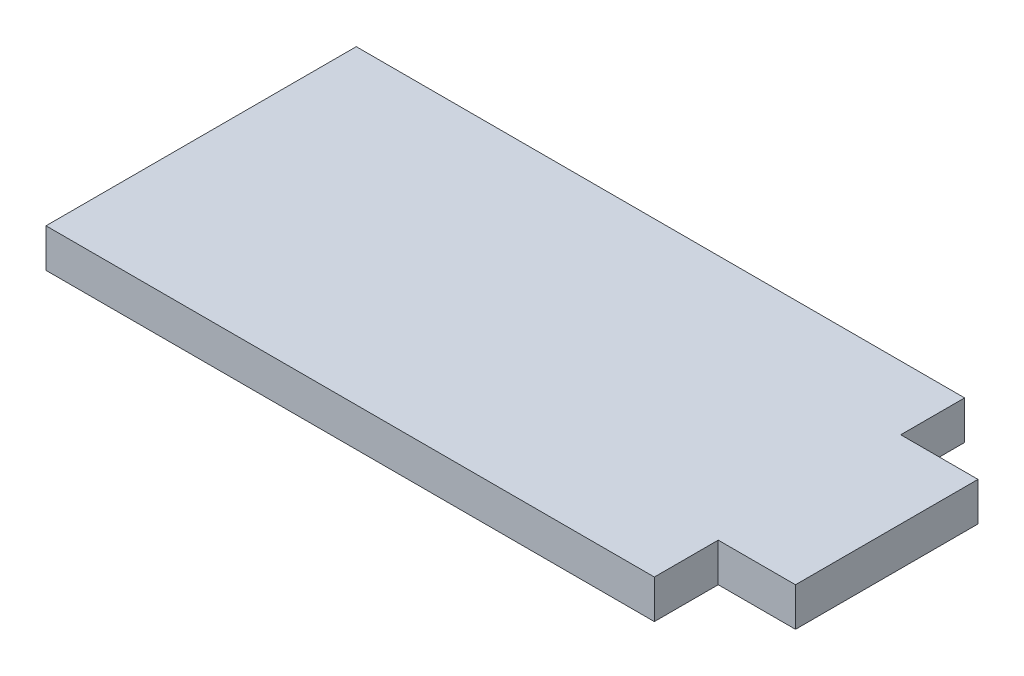
ISO-10303-21;
HEADER;
FILE_DESCRIPTION(('STEP AP214'),'2;1');
FILE_NAME('part.step','',(''),(''),'','','');
FILE_SCHEMA(('AUTOMOTIVE_DESIGN { 1 0 10303 214 1 1 1 1 }'));
ENDSEC;
DATA;
#1=APPLICATION_CONTEXT('core data for automotive mechanical design processes');
#2=APPLICATION_PROTOCOL_DEFINITION('international standard','automotive_design',2000,#1);
#3=PRODUCT_CONTEXT('',#1,'mechanical');
#4=PRODUCT('Part','Part','',(#3));
#5=PRODUCT_RELATED_PRODUCT_CATEGORY('part','',(#4));
#6=PRODUCT_DEFINITION_FORMATION('','',#4);
#7=PRODUCT_DEFINITION_CONTEXT('part definition',#1,'design');
#8=PRODUCT_DEFINITION('design','',#6,#7);
#9=PRODUCT_DEFINITION_SHAPE('','',#8);
#10=(LENGTH_UNIT() NAMED_UNIT(*) SI_UNIT(.MILLI.,.METRE.));
#11=(NAMED_UNIT(*) PLANE_ANGLE_UNIT() SI_UNIT($,.RADIAN.));
#12=(NAMED_UNIT(*) SI_UNIT($,.STERADIAN.) SOLID_ANGLE_UNIT());
#13=UNCERTAINTY_MEASURE_WITH_UNIT(LENGTH_MEASURE(1.E-05),#10,'distance_accuracy_value','');
#14=(GEOMETRIC_REPRESENTATION_CONTEXT(3) GLOBAL_UNCERTAINTY_ASSIGNED_CONTEXT((#13)) GLOBAL_UNIT_ASSIGNED_CONTEXT((#10,
#11,#12)) REPRESENTATION_CONTEXT('',''));
#15=CARTESIAN_POINT('',(0.,0.,0.));
#16=DIRECTION('',(0.,0.,1.));
#17=DIRECTION('',(1.,0.,0.));
#18=AXIS2_PLACEMENT_3D('',#15,#16,#17);
#19=CARTESIAN_POINT('',(-25.,3.175,0.));
#20=DIRECTION('',(-1.,0.,0.));
#21=DIRECTION('',(0.,0.,1.));
#22=AXIS2_PLACEMENT_3D('',#19,#20,#21);
#23=PLANE('',#22);
#24=DIRECTION('',(0.,0.,-1.));
#25=VECTOR('',#24,1.);
#26=CARTESIAN_POINT('',(-25.,0.,0.));
#27=LINE('',#26,#25);
#28=CARTESIAN_POINT('',(-25.,0.,20.25));
#29=VERTEX_POINT('',#28);
#30=CARTESIAN_POINT('',(-25.,0.,-5.25));
#31=VERTEX_POINT('',#30);
#32=EDGE_CURVE('E127',#29,#31,#27,.T.);
#33=ORIENTED_EDGE('',*,*,#32,.F.);
#34=DIRECTION('',(0.,-1.,0.));
#35=VECTOR('',#34,1.);
#36=CARTESIAN_POINT('',(-25.,3.175,20.25));
#37=LINE('',#36,#35);
#38=CARTESIAN_POINT('',(-25.,3.175,20.25));
#39=VERTEX_POINT('',#38);
#40=EDGE_CURVE('E11',#39,#29,#37,.T.);
#41=ORIENTED_EDGE('',*,*,#40,.F.);
#42=DIRECTION('',(0.,0.,-1.));
#43=VECTOR('',#42,1.);
#44=CARTESIAN_POINT('',(-25.,3.175,0.));
#45=LINE('',#44,#43);
#46=CARTESIAN_POINT('',(-25.,3.175,-5.25));
#47=VERTEX_POINT('',#46);
#48=EDGE_CURVE('E147',#39,#47,#45,.T.);
#49=ORIENTED_EDGE('',*,*,#48,.T.);
#50=DIRECTION('',(0.,-1.,0.));
#51=VECTOR('',#50,1.);
#52=CARTESIAN_POINT('',(-25.,3.175,-5.25));
#53=LINE('',#52,#51);
#54=EDGE_CURVE('E50',#47,#31,#53,.T.);
#55=ORIENTED_EDGE('',*,*,#54,.T.);
#56=EDGE_LOOP('',(#33,#41,#49,#55));
#57=FACE_BOUND('',#56,.T.);
#58=ADVANCED_FACE('F34',(#57),#23,.T.);
#59=CARTESIAN_POINT('',(0.,3.175,20.25));
#60=DIRECTION('',(0.,0.,1.));
#61=DIRECTION('',(1.,0.,0.));
#62=AXIS2_PLACEMENT_3D('',#59,#60,#61);
#63=PLANE('',#62);
#64=DIRECTION('',(-1.,0.,0.));
#65=VECTOR('',#64,1.);
#66=CARTESIAN_POINT('',(0.,0.,20.25));
#67=LINE('',#66,#65);
#68=CARTESIAN_POINT('',(25.,0.,20.25));
#69=VERTEX_POINT('',#68);
#70=EDGE_CURVE('E129',#69,#29,#67,.T.);
#71=ORIENTED_EDGE('',*,*,#70,.F.);
#72=DIRECTION('',(0.,-1.,0.));
#73=VECTOR('',#72,1.);
#74=CARTESIAN_POINT('',(25.,3.175,20.25));
#75=LINE('',#74,#73);
#76=CARTESIAN_POINT('',(25.,3.175,20.25));
#77=VERTEX_POINT('',#76);
#78=EDGE_CURVE('E42',#77,#69,#75,.T.);
#79=ORIENTED_EDGE('',*,*,#78,.F.);
#80=DIRECTION('',(-1.,0.,0.));
#81=VECTOR('',#80,1.);
#82=CARTESIAN_POINT('',(0.,3.175,20.25));
#83=LINE('',#82,#81);
#84=EDGE_CURVE('E173',#77,#39,#83,.T.);
#85=ORIENTED_EDGE('',*,*,#84,.T.);
#86=ORIENTED_EDGE('',*,*,#40,.T.);
#87=EDGE_LOOP('',(#71,#79,#85,#86));
#88=FACE_BOUND('',#87,.T.);
#89=ADVANCED_FACE('F164',(#88),#63,.T.);
#90=CARTESIAN_POINT('',(25.,3.175,0.));
#91=DIRECTION('',(1.,0.,0.));
#92=DIRECTION('',(0.,0.,-1.));
#93=AXIS2_PLACEMENT_3D('',#90,#91,#92);
#94=PLANE('',#93);
#95=DIRECTION('',(0.,0.,1.));
#96=VECTOR('',#95,1.);
#97=CARTESIAN_POINT('',(25.,0.,0.));
#98=LINE('',#97,#96);
#99=CARTESIAN_POINT('',(25.,0.,15.));
#100=VERTEX_POINT('',#99);
#101=EDGE_CURVE('E132',#100,#69,#98,.T.);
#102=ORIENTED_EDGE('',*,*,#101,.F.);
#103=DIRECTION('',(0.,-1.,0.));
#104=VECTOR('',#103,1.);
#105=CARTESIAN_POINT('',(25.,3.175,15.));
#106=LINE('',#105,#104);
#107=CARTESIAN_POINT('',(25.,3.175,15.));
#108=VERTEX_POINT('',#107);
#109=EDGE_CURVE('E153',#108,#100,#106,.T.);
#110=ORIENTED_EDGE('',*,*,#109,.F.);
#111=DIRECTION('',(0.,0.,1.));
#112=VECTOR('',#111,1.);
#113=CARTESIAN_POINT('',(25.,3.175,0.));
#114=LINE('',#113,#112);
#115=EDGE_CURVE('E160',#108,#77,#114,.T.);
#116=ORIENTED_EDGE('',*,*,#115,.T.);
#117=ORIENTED_EDGE('',*,*,#78,.T.);
#118=EDGE_LOOP('',(#102,#110,#116,#117));
#119=FACE_BOUND('',#118,.T.);
#120=ADVANCED_FACE('F158',(#119),#94,.T.);
#121=CARTESIAN_POINT('',(0.,3.175,15.));
#122=DIRECTION('',(0.,0.,1.));
#123=DIRECTION('',(1.,0.,0.));
#124=AXIS2_PLACEMENT_3D('',#121,#122,#123);
#125=PLANE('',#124);
#126=DIRECTION('',(-1.,0.,0.));
#127=VECTOR('',#126,1.);
#128=CARTESIAN_POINT('',(0.,0.,15.));
#129=LINE('',#128,#127);
#130=CARTESIAN_POINT('',(31.35,0.,15.));
#131=VERTEX_POINT('',#130);
#132=EDGE_CURVE('E135',#131,#100,#129,.T.);
#133=ORIENTED_EDGE('',*,*,#132,.F.);
#134=DIRECTION('',(0.,-1.,0.));
#135=VECTOR('',#134,1.);
#136=CARTESIAN_POINT('',(31.35,3.175,15.));
#137=LINE('',#136,#135);
#138=CARTESIAN_POINT('',(31.35,3.175,15.));
#139=VERTEX_POINT('',#138);
#140=EDGE_CURVE('E151',#139,#131,#137,.T.);
#141=ORIENTED_EDGE('',*,*,#140,.F.);
#142=DIRECTION('',(-1.,0.,0.));
#143=VECTOR('',#142,1.);
#144=CARTESIAN_POINT('',(0.,3.175,15.));
#145=LINE('',#144,#143);
#146=EDGE_CURVE('E172',#139,#108,#145,.T.);
#147=ORIENTED_EDGE('',*,*,#146,.T.);
#148=ORIENTED_EDGE('',*,*,#109,.T.);
#149=EDGE_LOOP('',(#133,#141,#147,#148));
#150=FACE_BOUND('',#149,.T.);
#151=ADVANCED_FACE('F170',(#150),#125,.T.);
#152=CARTESIAN_POINT('',(31.35,3.175,0.));
#153=DIRECTION('',(1.,0.,0.));
#154=DIRECTION('',(0.,0.,-1.));
#155=AXIS2_PLACEMENT_3D('',#152,#153,#154);
#156=PLANE('',#155);
#157=DIRECTION('',(0.,0.,1.));
#158=VECTOR('',#157,1.);
#159=CARTESIAN_POINT('',(31.35,0.,0.));
#160=LINE('',#159,#158);
#161=CARTESIAN_POINT('',(31.35,0.,0.));
#162=VERTEX_POINT('',#161);
#163=EDGE_CURVE('E138',#162,#131,#160,.T.);
#164=ORIENTED_EDGE('',*,*,#163,.F.);
#165=DIRECTION('',(0.,-1.,0.));
#166=VECTOR('',#165,1.);
#167=CARTESIAN_POINT('',(31.35,3.175,0.));
#168=LINE('',#167,#166);
#169=CARTESIAN_POINT('',(31.35,3.175,0.));
#170=VERTEX_POINT('',#169);
#171=EDGE_CURVE('E109',#170,#162,#168,.T.);
#172=ORIENTED_EDGE('',*,*,#171,.F.);
#173=DIRECTION('',(0.,0.,1.));
#174=VECTOR('',#173,1.);
#175=CARTESIAN_POINT('',(31.35,3.175,0.));
#176=LINE('',#175,#174);
#177=EDGE_CURVE('E119',#170,#139,#176,.T.);
#178=ORIENTED_EDGE('',*,*,#177,.T.);
#179=ORIENTED_EDGE('',*,*,#140,.T.);
#180=EDGE_LOOP('',(#164,#172,#178,#179));
#181=FACE_BOUND('',#180,.T.);
#182=ADVANCED_FACE('F179',(#181),#156,.T.);
#183=CARTESIAN_POINT('',(0.,3.175,0.));
#184=DIRECTION('',(0.,0.,-1.));
#185=DIRECTION('',(-1.,0.,0.));
#186=AXIS2_PLACEMENT_3D('',#183,#184,#185);
#187=PLANE('',#186);
#188=DIRECTION('',(1.,0.,0.));
#189=VECTOR('',#188,1.);
#190=CARTESIAN_POINT('',(0.,0.,0.));
#191=LINE('',#190,#189);
#192=CARTESIAN_POINT('',(25.,0.,0.));
#193=VERTEX_POINT('',#192);
#194=EDGE_CURVE('E105',#193,#162,#191,.T.);
#195=ORIENTED_EDGE('',*,*,#194,.F.);
#196=DIRECTION('',(0.,-1.,0.));
#197=VECTOR('',#196,1.);
#198=CARTESIAN_POINT('',(25.,3.175,0.));
#199=LINE('',#198,#197);
#200=CARTESIAN_POINT('',(25.,3.175,0.));
#201=VERTEX_POINT('',#200);
#202=EDGE_CURVE('E100',#201,#193,#199,.T.);
#203=ORIENTED_EDGE('',*,*,#202,.F.);
#204=DIRECTION('',(1.,0.,0.));
#205=VECTOR('',#204,1.);
#206=CARTESIAN_POINT('',(0.,3.175,0.));
#207=LINE('',#206,#205);
#208=EDGE_CURVE('E103',#201,#170,#207,.T.);
#209=ORIENTED_EDGE('',*,*,#208,.T.);
#210=ORIENTED_EDGE('',*,*,#171,.T.);
#211=EDGE_LOOP('',(#195,#203,#209,#210));
#212=FACE_BOUND('',#211,.T.);
#213=ADVANCED_FACE('F102',(#212),#187,.T.);
#214=CARTESIAN_POINT('',(25.,3.175,0.));
#215=DIRECTION('',(1.,0.,0.));
#216=DIRECTION('',(0.,0.,-1.));
#217=AXIS2_PLACEMENT_3D('',#214,#215,#216);
#218=PLANE('',#217);
#219=DIRECTION('',(0.,0.,1.));
#220=VECTOR('',#219,1.);
#221=CARTESIAN_POINT('',(25.,0.,0.));
#222=LINE('',#221,#220);
#223=CARTESIAN_POINT('',(25.,0.,-5.25));
#224=VERTEX_POINT('',#223);
#225=EDGE_CURVE('E142',#224,#193,#222,.T.);
#226=ORIENTED_EDGE('',*,*,#225,.F.);
#227=DIRECTION('',(0.,-1.,0.));
#228=VECTOR('',#227,1.);
#229=CARTESIAN_POINT('',(25.,3.175,-5.25));
#230=LINE('',#229,#228);
#231=CARTESIAN_POINT('',(25.,3.175,-5.25));
#232=VERTEX_POINT('',#231);
#233=EDGE_CURVE('E75',#232,#224,#230,.T.);
#234=ORIENTED_EDGE('',*,*,#233,.F.);
#235=DIRECTION('',(0.,0.,1.));
#236=VECTOR('',#235,1.);
#237=CARTESIAN_POINT('',(25.,3.175,0.));
#238=LINE('',#237,#236);
#239=EDGE_CURVE('E116',#232,#201,#238,.T.);
#240=ORIENTED_EDGE('',*,*,#239,.T.);
#241=ORIENTED_EDGE('',*,*,#202,.T.);
#242=EDGE_LOOP('',(#226,#234,#240,#241));
#243=FACE_BOUND('',#242,.T.);
#244=ADVANCED_FACE('F121',(#243),#218,.T.);
#245=CARTESIAN_POINT('',(0.,3.175,-5.25));
#246=DIRECTION('',(0.,0.,-1.));
#247=DIRECTION('',(-1.,0.,0.));
#248=AXIS2_PLACEMENT_3D('',#245,#246,#247);
#249=PLANE('',#248);
#250=DIRECTION('',(1.,0.,0.));
#251=VECTOR('',#250,1.);
#252=CARTESIAN_POINT('',(0.,0.,-5.25));
#253=LINE('',#252,#251);
#254=EDGE_CURVE('E144',#31,#224,#253,.T.);
#255=ORIENTED_EDGE('',*,*,#254,.F.);
#256=ORIENTED_EDGE('',*,*,#54,.F.);
#257=DIRECTION('',(1.,0.,0.));
#258=VECTOR('',#257,1.);
#259=CARTESIAN_POINT('',(0.,3.175,-5.25));
#260=LINE('',#259,#258);
#261=EDGE_CURVE('E122',#47,#232,#260,.T.);
#262=ORIENTED_EDGE('',*,*,#261,.T.);
#263=ORIENTED_EDGE('',*,*,#233,.T.);
#264=EDGE_LOOP('',(#255,#256,#262,#263));
#265=FACE_BOUND('',#264,.T.);
#266=ADVANCED_FACE('F180',(#265),#249,.T.);
#267=CARTESIAN_POINT('',(0.,3.175,0.));
#268=DIRECTION('',(0.,1.,0.));
#269=DIRECTION('',(0.,0.,1.));
#270=AXIS2_PLACEMENT_3D('',#267,#268,#269);
#271=PLANE('',#270);
#272=ORIENTED_EDGE('',*,*,#48,.F.);
#273=ORIENTED_EDGE('',*,*,#84,.F.);
#274=ORIENTED_EDGE('',*,*,#115,.F.);
#275=ORIENTED_EDGE('',*,*,#146,.F.);
#276=ORIENTED_EDGE('',*,*,#177,.F.);
#277=ORIENTED_EDGE('',*,*,#208,.F.);
#278=ORIENTED_EDGE('',*,*,#239,.F.);
#279=ORIENTED_EDGE('',*,*,#261,.F.);
#280=EDGE_LOOP('',(#272,#273,#274,#275,#276,#277,#278,#279));
#281=FACE_BOUND('',#280,.T.);
#282=ADVANCED_FACE('F114',(#281),#271,.T.);
#283=CARTESIAN_POINT('',(0.,0.,0.));
#284=DIRECTION('',(0.,1.,0.));
#285=DIRECTION('',(0.,0.,1.));
#286=AXIS2_PLACEMENT_3D('',#283,#284,#285);
#287=PLANE('',#286);
#288=ORIENTED_EDGE('',*,*,#32,.T.);
#289=ORIENTED_EDGE('',*,*,#254,.T.);
#290=ORIENTED_EDGE('',*,*,#225,.T.);
#291=ORIENTED_EDGE('',*,*,#194,.T.);
#292=ORIENTED_EDGE('',*,*,#163,.T.);
#293=ORIENTED_EDGE('',*,*,#132,.T.);
#294=ORIENTED_EDGE('',*,*,#101,.T.);
#295=ORIENTED_EDGE('',*,*,#70,.T.);
#296=EDGE_LOOP('',(#288,#289,#290,#291,#292,#293,#294,#295));
#297=FACE_BOUND('',#296,.T.);
#298=ADVANCED_FACE('F166',(#297),#287,.F.);
#299=CLOSED_SHELL('',(#58,#89,#120,#151,#182,#213,#244,#266,#282,#298));
#300=MANIFOLD_SOLID_BREP('B2',#299);
#301=ADVANCED_BREP_SHAPE_REPRESENTATION('',(#18,#300),#14);
#302=SHAPE_DEFINITION_REPRESENTATION(#9,#301);
ENDSEC;
END-ISO-10303-21;
